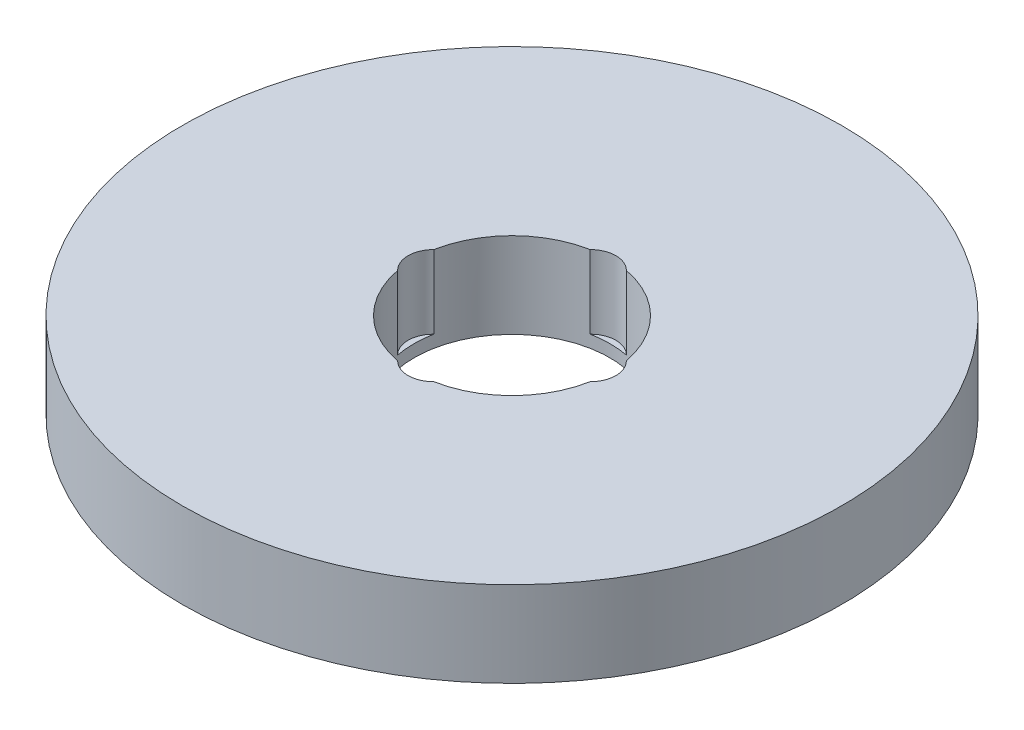
ISO-10303-21;
HEADER;
FILE_DESCRIPTION(('STEP AP214'),'2;1');
FILE_NAME('part.step','',(''),(''),'','','');
FILE_SCHEMA(('AUTOMOTIVE_DESIGN { 1 0 10303 214 1 1 1 1 }'));
ENDSEC;
DATA;
#1=APPLICATION_CONTEXT('core data for automotive mechanical design processes');
#2=APPLICATION_PROTOCOL_DEFINITION('international standard','automotive_design',2000,#1);
#3=PRODUCT_CONTEXT('',#1,'mechanical');
#4=PRODUCT('Part','Part','',(#3));
#5=PRODUCT_RELATED_PRODUCT_CATEGORY('part','',(#4));
#6=PRODUCT_DEFINITION_FORMATION('','',#4);
#7=PRODUCT_DEFINITION_CONTEXT('part definition',#1,'design');
#8=PRODUCT_DEFINITION('design','',#6,#7);
#9=PRODUCT_DEFINITION_SHAPE('','',#8);
#10=(LENGTH_UNIT() NAMED_UNIT(*) SI_UNIT(.MILLI.,.METRE.));
#11=(NAMED_UNIT(*) PLANE_ANGLE_UNIT() SI_UNIT($,.RADIAN.));
#12=(NAMED_UNIT(*) SI_UNIT($,.STERADIAN.) SOLID_ANGLE_UNIT());
#13=UNCERTAINTY_MEASURE_WITH_UNIT(LENGTH_MEASURE(1.E-05),#10,'distance_accuracy_value','');
#14=(GEOMETRIC_REPRESENTATION_CONTEXT(3) GLOBAL_UNCERTAINTY_ASSIGNED_CONTEXT((#13)) GLOBAL_UNIT_ASSIGNED_CONTEXT((#10,
#11,#12)) REPRESENTATION_CONTEXT('',''));
#15=CARTESIAN_POINT('',(0.,0.,0.));
#16=DIRECTION('',(0.,0.,1.));
#17=DIRECTION('',(1.,0.,0.));
#18=AXIS2_PLACEMENT_3D('',#15,#16,#17);
#19=CARTESIAN_POINT('',(0.,24.,0.));
#20=DIRECTION('',(0.,-1.,0.));
#21=DIRECTION('',(0.,0.,-1.));
#22=AXIS2_PLACEMENT_3D('',#19,#20,#21);
#23=CYLINDRICAL_SURFACE('',#22,92.5);
#24=CARTESIAN_POINT('',(0.,24.,0.));
#25=DIRECTION('',(0.,1.,0.));
#26=DIRECTION('',(0.,0.,1.));
#27=AXIS2_PLACEMENT_3D('',#24,#25,#26);
#28=CIRCLE('',#27,92.5);
#29=CARTESIAN_POINT('',(0.,24.,92.5));
#30=VERTEX_POINT('',#29);
#31=EDGE_CURVE('E148',#30,#30,#28,.T.);
#32=ORIENTED_EDGE('',*,*,#31,.F.);
#33=EDGE_LOOP('',(#32));
#34=FACE_BOUND('',#33,.T.);
#35=CARTESIAN_POINT('',(0.,0.,0.));
#36=DIRECTION('',(0.,1.,0.));
#37=DIRECTION('',(0.,0.,1.));
#38=AXIS2_PLACEMENT_3D('',#35,#36,#37);
#39=CIRCLE('',#38,92.5);
#40=CARTESIAN_POINT('',(0.,0.,92.5));
#41=VERTEX_POINT('',#40);
#42=EDGE_CURVE('E139',#41,#41,#39,.T.);
#43=ORIENTED_EDGE('',*,*,#42,.T.);
#44=EDGE_LOOP('',(#43));
#45=FACE_BOUND('',#44,.T.);
#46=ADVANCED_FACE('F39',(#34,#45),#23,.T.);
#47=CARTESIAN_POINT('',(0.,24.,0.));
#48=DIRECTION('',(0.,1.,0.));
#49=DIRECTION('',(0.,0.,1.));
#50=AXIS2_PLACEMENT_3D('',#47,#48,#49);
#51=PLANE('',#50);
#52=CARTESIAN_POINT('',(0.,24.,22.0384043589345));
#53=DIRECTION('',(0.,1.,0.));
#54=DIRECTION('',(1.,0.,0.));
#55=AXIS2_PLACEMENT_3D('',#52,#53,#54);
#56=CIRCLE('',#55,7.11614728250659);
#57=CARTESIAN_POINT('',(-5.07394396477258,24.,27.0278577146312));
#58=VERTEX_POINT('',#57);
#59=CARTESIAN_POINT('',(5.07394396477277,24.,27.0278577146311));
#60=VERTEX_POINT('',#59);
#61=EDGE_CURVE('E175',#58,#60,#56,.T.);
#62=ORIENTED_EDGE('',*,*,#61,.F.);
#63=CARTESIAN_POINT('',(0.,24.,0.));
#64=DIRECTION('',(0.,1.,0.));
#65=DIRECTION('',(0.,0.,1.));
#66=AXIS2_PLACEMENT_3D('',#63,#64,#65);
#67=CIRCLE('',#66,27.5);
#68=CARTESIAN_POINT('',(-27.0278577146312,24.,5.07394396477268));
#69=VERTEX_POINT('',#68);
#70=EDGE_CURVE('E134',#69,#58,#67,.T.);
#71=ORIENTED_EDGE('',*,*,#70,.F.);
#72=CARTESIAN_POINT('',(-22.0384043589345,24.,0.));
#73=DIRECTION('',(0.,1.,0.));
#74=DIRECTION('',(0.,0.,1.));
#75=AXIS2_PLACEMENT_3D('',#72,#73,#74);
#76=CIRCLE('',#75,7.11614728250659);
#77=CARTESIAN_POINT('',(-27.0278577146312,24.,-5.07394396477268));
#78=VERTEX_POINT('',#77);
#79=EDGE_CURVE('E143',#78,#69,#76,.T.);
#80=ORIENTED_EDGE('',*,*,#79,.F.);
#81=CARTESIAN_POINT('',(-5.07394396477296,24.,-27.0278577146311));
#82=VERTEX_POINT('',#81);
#83=EDGE_CURVE('E123',#82,#78,#67,.T.);
#84=ORIENTED_EDGE('',*,*,#83,.F.);
#85=CARTESIAN_POINT('',(-2.30840032671297E-13,24.,-22.0384043589345));
#86=DIRECTION('',(0.,1.,0.));
#87=DIRECTION('',(-1.,0.,0.));
#88=AXIS2_PLACEMENT_3D('',#85,#86,#87);
#89=CIRCLE('',#88,7.11614728250659);
#90=CARTESIAN_POINT('',(5.0739439647724,24.,-27.0278577146312));
#91=VERTEX_POINT('',#90);
#92=EDGE_CURVE('E106',#91,#82,#89,.T.);
#93=ORIENTED_EDGE('',*,*,#92,.F.);
#94=CARTESIAN_POINT('',(27.0278577146312,24.,-5.07394396477268));
#95=VERTEX_POINT('',#94);
#96=EDGE_CURVE('E125',#95,#91,#67,.T.);
#97=ORIENTED_EDGE('',*,*,#96,.F.);
#98=CARTESIAN_POINT('',(22.0384043589345,24.,0.));
#99=DIRECTION('',(0.,1.,0.));
#100=DIRECTION('',(0.,0.,-1.));
#101=AXIS2_PLACEMENT_3D('',#98,#99,#100);
#102=CIRCLE('',#101,7.11614728250659);
#103=CARTESIAN_POINT('',(27.0278577146312,24.,5.07394396477268));
#104=VERTEX_POINT('',#103);
#105=EDGE_CURVE('E286',#104,#95,#102,.T.);
#106=ORIENTED_EDGE('',*,*,#105,.F.);
#107=EDGE_CURVE('E135',#60,#104,#67,.T.);
#108=ORIENTED_EDGE('',*,*,#107,.F.);
#109=EDGE_LOOP('',(#62,#71,#80,#84,#93,#97,#106,#108));
#110=FACE_BOUND('',#109,.T.);
#111=ORIENTED_EDGE('',*,*,#31,.T.);
#112=EDGE_LOOP('',(#111));
#113=FACE_BOUND('',#112,.T.);
#114=ADVANCED_FACE('F118',(#110,#113),#51,.T.);
#115=CARTESIAN_POINT('',(0.,0.,0.));
#116=DIRECTION('',(0.,1.,0.));
#117=DIRECTION('',(0.,0.,1.));
#118=AXIS2_PLACEMENT_3D('',#115,#116,#117);
#119=PLANE('',#118);
#120=CARTESIAN_POINT('',(0.,0.,0.));
#121=DIRECTION('',(0.,1.,0.));
#122=DIRECTION('',(0.,0.,1.));
#123=AXIS2_PLACEMENT_3D('',#120,#121,#122);
#124=CIRCLE('',#123,27.5);
#125=CARTESIAN_POINT('',(0.,0.,27.5));
#126=VERTEX_POINT('',#125);
#127=EDGE_CURVE('E136',#126,#126,#124,.T.);
#128=ORIENTED_EDGE('',*,*,#127,.T.);
#129=EDGE_LOOP('',(#128));
#130=FACE_BOUND('',#129,.T.);
#131=ORIENTED_EDGE('',*,*,#42,.F.);
#132=EDGE_LOOP('',(#131));
#133=FACE_BOUND('',#132,.T.);
#134=ADVANCED_FACE('F187',(#130,#133),#119,.F.);
#135=CARTESIAN_POINT('',(0.,24.,0.));
#136=DIRECTION('',(0.,-1.,0.));
#137=DIRECTION('',(0.,0.,-1.));
#138=AXIS2_PLACEMENT_3D('',#135,#136,#137);
#139=CYLINDRICAL_SURFACE('',#138,27.5);
#140=DIRECTION('',(0.,1.,0.));
#141=VECTOR('',#140,1.);
#142=CARTESIAN_POINT('',(-5.07394396477259,13.7205148276112,27.0278577146312));
#143=LINE('',#142,#141);
#144=CARTESIAN_POINT('',(-5.07394396477258,3.44102965522246,27.0278577146312));
#145=VERTEX_POINT('',#144);
#146=EDGE_CURVE('E11',#145,#58,#143,.T.);
#147=ORIENTED_EDGE('',*,*,#146,.F.);
#148=CARTESIAN_POINT('',(0.,3.44102965522246,0.));
#149=DIRECTION('',(0.,1.,0.));
#150=DIRECTION('',(0.,0.,1.));
#151=AXIS2_PLACEMENT_3D('',#148,#149,#150);
#152=CIRCLE('',#151,27.5);
#153=CARTESIAN_POINT('',(5.07394396477277,3.44102965522246,27.0278577146311));
#154=VERTEX_POINT('',#153);
#155=EDGE_CURVE('E170',#145,#154,#152,.T.);
#156=ORIENTED_EDGE('',*,*,#155,.T.);
#157=DIRECTION('',(0.,1.,0.));
#158=VECTOR('',#157,1.);
#159=CARTESIAN_POINT('',(5.07394396477277,13.7205148276112,27.0278577146311));
#160=LINE('',#159,#158);
#161=EDGE_CURVE('E46',#60,#154,#160,.F.);
#162=ORIENTED_EDGE('',*,*,#161,.F.);
#163=ORIENTED_EDGE('',*,*,#107,.T.);
#164=DIRECTION('',(0.,1.,0.));
#165=VECTOR('',#164,1.);
#166=CARTESIAN_POINT('',(27.0278577146312,13.7205148276112,5.07394396477268));
#167=LINE('',#166,#165);
#168=CARTESIAN_POINT('',(27.0278577146312,3.44102965522246,5.07394396477268));
#169=VERTEX_POINT('',#168);
#170=EDGE_CURVE('E164',#169,#104,#167,.T.);
#171=ORIENTED_EDGE('',*,*,#170,.F.);
#172=CARTESIAN_POINT('',(0.,3.44102965522246,0.));
#173=DIRECTION('',(0.,1.,0.));
#174=DIRECTION('',(0.,0.,1.));
#175=AXIS2_PLACEMENT_3D('',#172,#173,#174);
#176=CIRCLE('',#175,27.5);
#177=CARTESIAN_POINT('',(27.0278577146312,3.44102965522246,-5.07394396477268));
#178=VERTEX_POINT('',#177);
#179=EDGE_CURVE('E115',#169,#178,#176,.T.);
#180=ORIENTED_EDGE('',*,*,#179,.T.);
#181=DIRECTION('',(0.,1.,0.));
#182=VECTOR('',#181,1.);
#183=CARTESIAN_POINT('',(27.0278577146312,13.7205148276112,-5.07394396477268));
#184=LINE('',#183,#182);
#185=EDGE_CURVE('E131',#95,#178,#184,.F.);
#186=ORIENTED_EDGE('',*,*,#185,.F.);
#187=ORIENTED_EDGE('',*,*,#96,.T.);
#188=DIRECTION('',(0.,1.,0.));
#189=VECTOR('',#188,1.);
#190=CARTESIAN_POINT('',(5.0739439647724,13.7205148276112,-27.0278577146312));
#191=LINE('',#190,#189);
#192=CARTESIAN_POINT('',(5.0739439647724,3.44102965522246,-27.0278577146312));
#193=VERTEX_POINT('',#192);
#194=EDGE_CURVE('E105',#193,#91,#191,.T.);
#195=ORIENTED_EDGE('',*,*,#194,.F.);
#196=CARTESIAN_POINT('',(0.,3.44102965522246,0.));
#197=DIRECTION('',(0.,1.,0.));
#198=DIRECTION('',(0.,0.,1.));
#199=AXIS2_PLACEMENT_3D('',#196,#197,#198);
#200=CIRCLE('',#199,27.5);
#201=CARTESIAN_POINT('',(-5.07394396477296,3.44102965522246,-27.0278577146311));
#202=VERTEX_POINT('',#201);
#203=EDGE_CURVE('E159',#193,#202,#200,.T.);
#204=ORIENTED_EDGE('',*,*,#203,.T.);
#205=DIRECTION('',(0.,1.,0.));
#206=VECTOR('',#205,1.);
#207=CARTESIAN_POINT('',(-5.07394396477296,13.7205148276112,-27.0278577146311));
#208=LINE('',#207,#206);
#209=EDGE_CURVE('E114',#82,#202,#208,.F.);
#210=ORIENTED_EDGE('',*,*,#209,.F.);
#211=ORIENTED_EDGE('',*,*,#83,.T.);
#212=DIRECTION('',(0.,1.,0.));
#213=VECTOR('',#212,1.);
#214=CARTESIAN_POINT('',(-27.0278577146312,13.7205148276112,-5.07394396477268));
#215=LINE('',#214,#213);
#216=CARTESIAN_POINT('',(-27.0278577146312,3.44102965522246,-5.07394396477268));
#217=VERTEX_POINT('',#216);
#218=EDGE_CURVE('E160',#217,#78,#215,.T.);
#219=ORIENTED_EDGE('',*,*,#218,.F.);
#220=CARTESIAN_POINT('',(0.,3.44102965522246,0.));
#221=DIRECTION('',(0.,1.,0.));
#222=DIRECTION('',(0.,0.,1.));
#223=AXIS2_PLACEMENT_3D('',#220,#221,#222);
#224=CIRCLE('',#223,27.5);
#225=CARTESIAN_POINT('',(-27.0278577146312,3.44102965522246,5.07394396477268));
#226=VERTEX_POINT('',#225);
#227=EDGE_CURVE('E149',#217,#226,#224,.T.);
#228=ORIENTED_EDGE('',*,*,#227,.T.);
#229=DIRECTION('',(0.,1.,0.));
#230=VECTOR('',#229,1.);
#231=CARTESIAN_POINT('',(-27.0278577146312,13.7205148276112,5.07394396477268));
#232=LINE('',#231,#230);
#233=EDGE_CURVE('E152',#69,#226,#232,.F.);
#234=ORIENTED_EDGE('',*,*,#233,.F.);
#235=ORIENTED_EDGE('',*,*,#70,.T.);
#236=EDGE_LOOP('',(#147,#156,#162,#163,#171,#180,#186,#187,#195,#204,#210,#211,#219,#228,#234,#235));
#237=FACE_BOUND('',#236,.T.);
#238=ORIENTED_EDGE('',*,*,#127,.F.);
#239=EDGE_LOOP('',(#238));
#240=FACE_BOUND('',#239,.T.);
#241=ADVANCED_FACE('F126',(#237,#240),#139,.F.);
#242=CARTESIAN_POINT('',(-22.0384043589345,3.44102965522246,0.));
#243=DIRECTION('',(0.,1.,0.));
#244=DIRECTION('',(0.,0.,1.));
#245=AXIS2_PLACEMENT_3D('',#242,#243,#244);
#246=CYLINDRICAL_SURFACE('',#245,7.11614728250659);
#247=ORIENTED_EDGE('',*,*,#218,.T.);
#248=ORIENTED_EDGE('',*,*,#79,.T.);
#249=ORIENTED_EDGE('',*,*,#233,.T.);
#250=CARTESIAN_POINT('',(-22.0384043589345,3.44102965522246,0.));
#251=DIRECTION('',(0.,1.,0.));
#252=DIRECTION('',(0.,0.,1.));
#253=AXIS2_PLACEMENT_3D('',#250,#251,#252);
#254=CIRCLE('',#253,7.11614728250659);
#255=EDGE_CURVE('E144',#217,#226,#254,.T.);
#256=ORIENTED_EDGE('',*,*,#255,.F.);
#257=EDGE_LOOP('',(#247,#248,#249,#256));
#258=FACE_BOUND('',#257,.T.);
#259=ADVANCED_FACE('F200',(#258),#246,.F.);
#260=CARTESIAN_POINT('',(-22.0384043589345,3.44102965522246,0.));
#261=DIRECTION('',(0.,1.,0.));
#262=DIRECTION('',(0.,0.,1.));
#263=AXIS2_PLACEMENT_3D('',#260,#261,#262);
#264=PLANE('',#263);
#265=ORIENTED_EDGE('',*,*,#255,.T.);
#266=ORIENTED_EDGE('',*,*,#227,.F.);
#267=EDGE_LOOP('',(#265,#266));
#268=FACE_BOUND('',#267,.T.);
#269=ADVANCED_FACE('F201',(#268),#264,.T.);
#270=CARTESIAN_POINT('',(-2.30840032671297E-13,3.44102965522246,-22.0384043589345));
#271=DIRECTION('',(0.,1.,0.));
#272=DIRECTION('',(0.,0.,1.));
#273=AXIS2_PLACEMENT_3D('',#270,#271,#272);
#274=CYLINDRICAL_SURFACE('',#273,7.11614728250659);
#275=ORIENTED_EDGE('',*,*,#194,.T.);
#276=ORIENTED_EDGE('',*,*,#92,.T.);
#277=ORIENTED_EDGE('',*,*,#209,.T.);
#278=CARTESIAN_POINT('',(-2.30840032671297E-13,3.44102965522246,-22.0384043589345));
#279=DIRECTION('',(0.,1.,0.));
#280=DIRECTION('',(-1.,0.,0.));
#281=AXIS2_PLACEMENT_3D('',#278,#279,#280);
#282=CIRCLE('',#281,7.11614728250659);
#283=EDGE_CURVE('E107',#193,#202,#282,.T.);
#284=ORIENTED_EDGE('',*,*,#283,.F.);
#285=EDGE_LOOP('',(#275,#276,#277,#284));
#286=FACE_BOUND('',#285,.T.);
#287=ADVANCED_FACE('F102',(#286),#274,.F.);
#288=CARTESIAN_POINT('',(-2.30840032671297E-13,3.44102965522246,-22.0384043589345));
#289=DIRECTION('',(0.,1.,0.));
#290=DIRECTION('',(-1.,0.,0.));
#291=AXIS2_PLACEMENT_3D('',#288,#289,#290);
#292=PLANE('',#291);
#293=ORIENTED_EDGE('',*,*,#283,.T.);
#294=ORIENTED_EDGE('',*,*,#203,.F.);
#295=EDGE_LOOP('',(#293,#294));
#296=FACE_BOUND('',#295,.T.);
#297=ADVANCED_FACE('F209',(#296),#292,.T.);
#298=CARTESIAN_POINT('',(22.0384043589345,3.44102965522246,0.));
#299=DIRECTION('',(0.,1.,0.));
#300=DIRECTION('',(0.,0.,1.));
#301=AXIS2_PLACEMENT_3D('',#298,#299,#300);
#302=CYLINDRICAL_SURFACE('',#301,7.11614728250659);
#303=ORIENTED_EDGE('',*,*,#170,.T.);
#304=ORIENTED_EDGE('',*,*,#105,.T.);
#305=ORIENTED_EDGE('',*,*,#185,.T.);
#306=CARTESIAN_POINT('',(22.0384043589345,3.44102965522246,0.));
#307=DIRECTION('',(0.,1.,0.));
#308=DIRECTION('',(0.,0.,-1.));
#309=AXIS2_PLACEMENT_3D('',#306,#307,#308);
#310=CIRCLE('',#309,7.11614728250659);
#311=EDGE_CURVE('E56',#169,#178,#310,.T.);
#312=ORIENTED_EDGE('',*,*,#311,.F.);
#313=EDGE_LOOP('',(#303,#304,#305,#312));
#314=FACE_BOUND('',#313,.T.);
#315=ADVANCED_FACE('F213',(#314),#302,.F.);
#316=CARTESIAN_POINT('',(22.0384043589345,3.44102965522246,0.));
#317=DIRECTION('',(0.,1.,0.));
#318=DIRECTION('',(0.,0.,-1.));
#319=AXIS2_PLACEMENT_3D('',#316,#317,#318);
#320=PLANE('',#319);
#321=ORIENTED_EDGE('',*,*,#311,.T.);
#322=ORIENTED_EDGE('',*,*,#179,.F.);
#323=EDGE_LOOP('',(#321,#322));
#324=FACE_BOUND('',#323,.T.);
#325=ADVANCED_FACE('F179',(#324),#320,.T.);
#326=CARTESIAN_POINT('',(0.,3.44102965522246,22.0384043589345));
#327=DIRECTION('',(0.,1.,0.));
#328=DIRECTION('',(0.,0.,1.));
#329=AXIS2_PLACEMENT_3D('',#326,#327,#328);
#330=CYLINDRICAL_SURFACE('',#329,7.11614728250659);
#331=ORIENTED_EDGE('',*,*,#146,.T.);
#332=ORIENTED_EDGE('',*,*,#61,.T.);
#333=ORIENTED_EDGE('',*,*,#161,.T.);
#334=CARTESIAN_POINT('',(0.,3.44102965522246,22.0384043589345));
#335=DIRECTION('',(0.,1.,0.));
#336=DIRECTION('',(1.,0.,0.));
#337=AXIS2_PLACEMENT_3D('',#334,#335,#336);
#338=CIRCLE('',#337,7.11614728250659);
#339=EDGE_CURVE('E55',#145,#154,#338,.T.);
#340=ORIENTED_EDGE('',*,*,#339,.F.);
#341=EDGE_LOOP('',(#331,#332,#333,#340));
#342=FACE_BOUND('',#341,.T.);
#343=ADVANCED_FACE('F171',(#342),#330,.F.);
#344=CARTESIAN_POINT('',(0.,3.44102965522246,22.0384043589345));
#345=DIRECTION('',(0.,1.,0.));
#346=DIRECTION('',(1.,0.,0.));
#347=AXIS2_PLACEMENT_3D('',#344,#345,#346);
#348=PLANE('',#347);
#349=ORIENTED_EDGE('',*,*,#339,.T.);
#350=ORIENTED_EDGE('',*,*,#155,.F.);
#351=EDGE_LOOP('',(#349,#350));
#352=FACE_BOUND('',#351,.T.);
#353=ADVANCED_FACE('F173',(#352),#348,.T.);
#354=CLOSED_SHELL('',(#46,#114,#134,#241,#259,#269,#287,#297,#315,#325,#343,#353));
#355=MANIFOLD_SOLID_BREP('B2',#354);
#356=ADVANCED_BREP_SHAPE_REPRESENTATION('',(#18,#355),#14);
#357=SHAPE_DEFINITION_REPRESENTATION(#9,#356);
ENDSEC;
END-ISO-10303-21;
